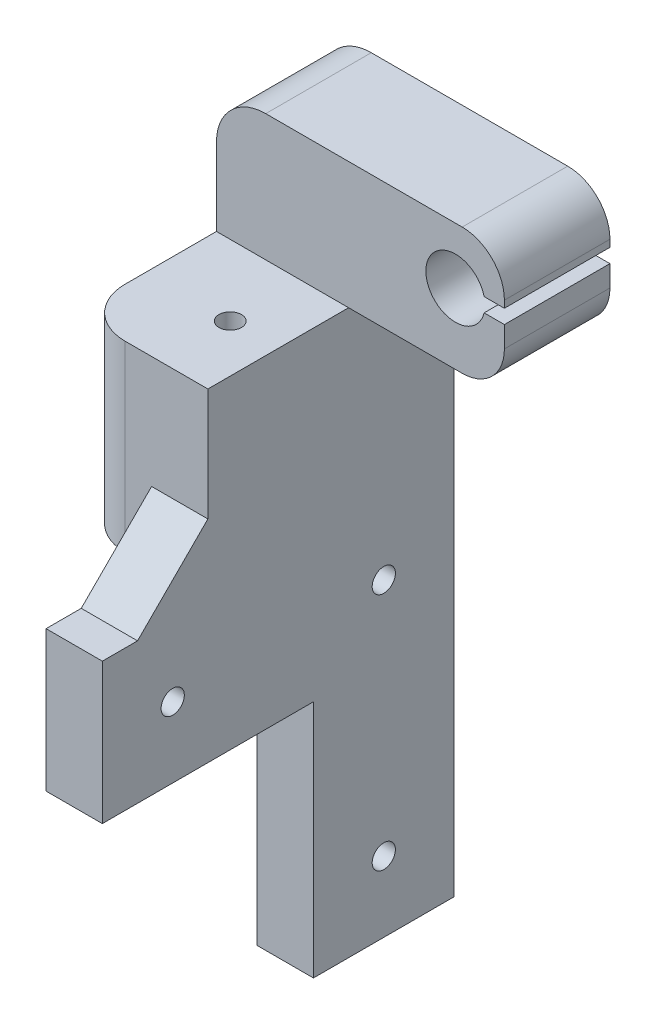
ISO-10303-21;
HEADER;
FILE_DESCRIPTION(('STEP AP214'),'2;1');
FILE_NAME('part.step','',(''),(''),'','','');
FILE_SCHEMA(('AUTOMOTIVE_DESIGN { 1 0 10303 214 1 1 1 1 }'));
ENDSEC;
DATA;
#1=APPLICATION_CONTEXT('core data for automotive mechanical design processes');
#2=APPLICATION_PROTOCOL_DEFINITION('international standard','automotive_design',2000,#1);
#3=PRODUCT_CONTEXT('',#1,'mechanical');
#4=PRODUCT('Part','Part','',(#3));
#5=PRODUCT_RELATED_PRODUCT_CATEGORY('part','',(#4));
#6=PRODUCT_DEFINITION_FORMATION('','',#4);
#7=PRODUCT_DEFINITION_CONTEXT('part definition',#1,'design');
#8=PRODUCT_DEFINITION('design','',#6,#7);
#9=PRODUCT_DEFINITION_SHAPE('','',#8);
#10=(LENGTH_UNIT() NAMED_UNIT(*) SI_UNIT(.MILLI.,.METRE.));
#11=(NAMED_UNIT(*) PLANE_ANGLE_UNIT() SI_UNIT($,.RADIAN.));
#12=(NAMED_UNIT(*) SI_UNIT($,.STERADIAN.) SOLID_ANGLE_UNIT());
#13=UNCERTAINTY_MEASURE_WITH_UNIT(LENGTH_MEASURE(1.E-05),#10,'distance_accuracy_value','');
#14=(GEOMETRIC_REPRESENTATION_CONTEXT(3) GLOBAL_UNCERTAINTY_ASSIGNED_CONTEXT((#13)) GLOBAL_UNIT_ASSIGNED_CONTEXT((#10,
#11,#12)) REPRESENTATION_CONTEXT('',''));
#15=CARTESIAN_POINT('',(0.,0.,0.));
#16=DIRECTION('',(0.,0.,1.));
#17=DIRECTION('',(1.,0.,0.));
#18=AXIS2_PLACEMENT_3D('',#15,#16,#17);
#19=CARTESIAN_POINT('',(0.,0.,35.));
#20=DIRECTION('',(0.,0.,-1.));
#21=DIRECTION('',(-1.,0.,0.));
#22=AXIS2_PLACEMENT_3D('',#19,#20,#21);
#23=PLANE('',#22);
#24=DIRECTION('',(-1.,0.,0.));
#25=VECTOR('',#24,1.);
#26=CARTESIAN_POINT('',(0.,54.,35.));
#27=LINE('',#26,#25);
#28=CARTESIAN_POINT('',(0.,54.,35.));
#29=VERTEX_POINT('',#28);
#30=CARTESIAN_POINT('',(-3.78,54.,35.));
#31=VERTEX_POINT('',#30);
#32=EDGE_CURVE('E227',#29,#31,#27,.T.);
#33=ORIENTED_EDGE('',*,*,#32,.F.);
#34=DIRECTION('',(0.,1.,0.));
#35=VECTOR('',#34,1.);
#36=CARTESIAN_POINT('',(0.,0.,35.));
#37=LINE('',#36,#35);
#38=CARTESIAN_POINT('',(0.,63.9999999999999,35.));
#39=VERTEX_POINT('',#38);
#40=EDGE_CURVE('E337',#29,#39,#37,.T.);
#41=ORIENTED_EDGE('',*,*,#40,.T.);
#42=DIRECTION('',(1.,0.,0.));
#43=VECTOR('',#42,1.);
#44=CARTESIAN_POINT('',(8.,63.9999999999999,35.));
#45=LINE('',#44,#43);
#46=CARTESIAN_POINT('',(8.,63.9999999999999,35.));
#47=VERTEX_POINT('',#46);
#48=EDGE_CURVE('E335',#39,#47,#45,.T.);
#49=ORIENTED_EDGE('',*,*,#48,.T.);
#50=DIRECTION('',(0.,1.,0.));
#51=VECTOR('',#50,1.);
#52=CARTESIAN_POINT('',(8.,80.,35.));
#53=LINE('',#52,#51);
#54=CARTESIAN_POINT('',(8.,80.,35.));
#55=VERTEX_POINT('',#54);
#56=EDGE_CURVE('E303',#47,#55,#53,.T.);
#57=ORIENTED_EDGE('',*,*,#56,.T.);
#58=DIRECTION('',(-1.,0.,0.));
#59=VECTOR('',#58,1.);
#60=CARTESIAN_POINT('',(8.,80.,35.));
#61=LINE('',#60,#59);
#62=CARTESIAN_POINT('',(-3.78,80.,35.));
#63=VERTEX_POINT('',#62);
#64=EDGE_CURVE('E305',#55,#63,#61,.T.);
#65=ORIENTED_EDGE('',*,*,#64,.T.);
#66=DIRECTION('',(0.,-1.,0.));
#67=VECTOR('',#66,1.);
#68=CARTESIAN_POINT('',(-3.78,0.,35.));
#69=LINE('',#68,#67);
#70=EDGE_CURVE('E504',#63,#31,#69,.T.);
#71=ORIENTED_EDGE('',*,*,#70,.T.);
#72=EDGE_LOOP('',(#33,#41,#49,#57,#65,#71));
#73=FACE_BOUND('',#72,.T.);
#74=ADVANCED_FACE('F36',(#73),#23,.F.);
#75=CARTESIAN_POINT('',(-3.78,0.,28.));
#76=DIRECTION('',(0.,-1.,0.));
#77=DIRECTION('',(0.,0.,-1.));
#78=AXIS2_PLACEMENT_3D('',#75,#76,#77);
#79=CYLINDRICAL_SURFACE('',#78,7.);
#80=CARTESIAN_POINT('',(-3.78,54.,28.));
#81=DIRECTION('',(0.,1.,0.));
#82=DIRECTION('',(0.,0.,1.));
#83=AXIS2_PLACEMENT_3D('',#80,#81,#82);
#84=CIRCLE('',#83,7.);
#85=CARTESIAN_POINT('',(-10.78,54.,28.));
#86=VERTEX_POINT('',#85);
#87=EDGE_CURVE('E326',#31,#86,#84,.F.);
#88=ORIENTED_EDGE('',*,*,#87,.F.);
#89=ORIENTED_EDGE('',*,*,#70,.F.);
#90=CARTESIAN_POINT('',(-3.78,80.,28.));
#91=DIRECTION('',(0.,-1.,0.));
#92=DIRECTION('',(0.,0.,-1.));
#93=AXIS2_PLACEMENT_3D('',#90,#91,#92);
#94=CIRCLE('',#93,7.);
#95=CARTESIAN_POINT('',(-10.78,80.,28.));
#96=VERTEX_POINT('',#95);
#97=EDGE_CURVE('E330',#96,#63,#94,.F.);
#98=ORIENTED_EDGE('',*,*,#97,.F.);
#99=DIRECTION('',(0.,-1.,0.));
#100=VECTOR('',#99,1.);
#101=CARTESIAN_POINT('',(-10.78,54.,28.));
#102=LINE('',#101,#100);
#103=EDGE_CURVE('E328',#86,#96,#102,.F.);
#104=ORIENTED_EDGE('',*,*,#103,.F.);
#105=EDGE_LOOP('',(#88,#89,#98,#104));
#106=FACE_BOUND('',#105,.T.);
#107=ADVANCED_FACE('F382',(#106),#79,.T.);
#108=CARTESIAN_POINT('',(0.,50.,15.));
#109=DIRECTION('',(-0.707106781186551,-0.707106781186544,0.));
#110=DIRECTION('',(0.,0.,1.));
#111=AXIS2_PLACEMENT_3D('',#108,#109,#110);
#112=PLANE('',#111);
#113=DIRECTION('',(-0.707106781186544,0.707106781186551,0.));
#114=VECTOR('',#113,1.);
#115=CARTESIAN_POINT('',(0.,50.,20.));
#116=LINE('',#115,#114);
#117=CARTESIAN_POINT('',(-4.00000000000002,54.,20.));
#118=VERTEX_POINT('',#117);
#119=CARTESIAN_POINT('',(0.,50.,20.));
#120=VERTEX_POINT('',#119);
#121=EDGE_CURVE('E11',#118,#120,#116,.F.);
#122=ORIENTED_EDGE('',*,*,#121,.F.);
#123=DIRECTION('',(0.,0.,1.));
#124=VECTOR('',#123,1.);
#125=CARTESIAN_POINT('',(-3.99999999999999,54.,35.));
#126=LINE('',#125,#124);
#127=CARTESIAN_POINT('',(-3.99999999999999,54.,0.));
#128=VERTEX_POINT('',#127);
#129=EDGE_CURVE('E223',#128,#118,#126,.T.);
#130=ORIENTED_EDGE('',*,*,#129,.F.);
#131=DIRECTION('',(0.707106781186544,-0.707106781186551,0.));
#132=VECTOR('',#131,1.);
#133=CARTESIAN_POINT('',(25.,24.9999999999997,0.));
#134=LINE('',#133,#132);
#135=CARTESIAN_POINT('',(0.,50.,0.));
#136=VERTEX_POINT('',#135);
#137=EDGE_CURVE('E61',#136,#128,#134,.F.);
#138=ORIENTED_EDGE('',*,*,#137,.F.);
#139=DIRECTION('',(0.,0.,-1.));
#140=VECTOR('',#139,1.);
#141=CARTESIAN_POINT('',(0.,50.,0.));
#142=LINE('',#141,#140);
#143=EDGE_CURVE('E344',#120,#136,#142,.T.);
#144=ORIENTED_EDGE('',*,*,#143,.F.);
#145=EDGE_LOOP('',(#122,#130,#138,#144));
#146=FACE_BOUND('',#145,.T.);
#147=ADVANCED_FACE('F38',(#146),#112,.T.);
#148=CARTESIAN_POINT('',(0.,0.,15.));
#149=DIRECTION('',(1.,0.,0.));
#150=DIRECTION('',(0.,0.,-1.));
#151=AXIS2_PLACEMENT_3D('',#148,#149,#150);
#152=PLANE('',#151);
#153=CARTESIAN_POINT('',(0.,44.,10.));
#154=DIRECTION('',(-1.,0.,0.));
#155=DIRECTION('',(0.,0.,1.));
#156=AXIS2_PLACEMENT_3D('',#153,#154,#155);
#157=CIRCLE('',#156,1.65);
#158=CARTESIAN_POINT('',(0.,44.,11.65));
#159=VERTEX_POINT('',#158);
#160=EDGE_CURVE('E362',#159,#159,#157,.T.);
#161=ORIENTED_EDGE('',*,*,#160,.F.);
#162=EDGE_LOOP('',(#161));
#163=FACE_BOUND('',#162,.T.);
#164=CARTESIAN_POINT('',(0.,10.,10.));
#165=DIRECTION('',(-1.,0.,0.));
#166=DIRECTION('',(0.,0.,1.));
#167=AXIS2_PLACEMENT_3D('',#164,#165,#166);
#168=CIRCLE('',#167,1.65);
#169=CARTESIAN_POINT('',(0.,10.,11.65));
#170=VERTEX_POINT('',#169);
#171=EDGE_CURVE('E353',#170,#170,#168,.T.);
#172=ORIENTED_EDGE('',*,*,#171,.F.);
#173=EDGE_LOOP('',(#172));
#174=FACE_BOUND('',#173,.T.);
#175=DIRECTION('',(0.,1.,0.));
#176=VECTOR('',#175,1.);
#177=CARTESIAN_POINT('',(0.,-99.,24.0148188564314));
#178=LINE('',#177,#176);
#179=CARTESIAN_POINT('',(0.,33.9999999999999,24.0148188564314));
#180=VERTEX_POINT('',#179);
#181=CARTESIAN_POINT('',(0.,54.,24.0148188564314));
#182=VERTEX_POINT('',#181);
#183=EDGE_CURVE('E235',#180,#182,#178,.T.);
#184=ORIENTED_EDGE('',*,*,#183,.T.);
#185=DIRECTION('',(0.,0.,-1.));
#186=VECTOR('',#185,1.);
#187=CARTESIAN_POINT('',(0.,54.,20.));
#188=LINE('',#187,#186);
#189=CARTESIAN_POINT('',(0.,54.,20.));
#190=VERTEX_POINT('',#189);
#191=EDGE_CURVE('E221',#182,#190,#188,.T.);
#192=ORIENTED_EDGE('',*,*,#191,.T.);
#193=DIRECTION('',(0.,-1.,0.));
#194=VECTOR('',#193,1.);
#195=CARTESIAN_POINT('',(0.,34.,20.));
#196=LINE('',#195,#194);
#197=EDGE_CURVE('E228',#190,#120,#196,.T.);
#198=ORIENTED_EDGE('',*,*,#197,.T.);
#199=ORIENTED_EDGE('',*,*,#143,.T.);
#200=DIRECTION('',(0.,-1.,0.));
#201=VECTOR('',#200,1.);
#202=CARTESIAN_POINT('',(0.,0.,0.));
#203=LINE('',#202,#201);
#204=CARTESIAN_POINT('',(0.,0.,0.));
#205=VERTEX_POINT('',#204);
#206=EDGE_CURVE('E446',#136,#205,#203,.T.);
#207=ORIENTED_EDGE('',*,*,#206,.T.);
#208=DIRECTION('',(0.,0.,-1.));
#209=VECTOR('',#208,1.);
#210=CARTESIAN_POINT('',(0.,0.,15.));
#211=LINE('',#210,#209);
#212=CARTESIAN_POINT('',(0.,0.,20.));
#213=VERTEX_POINT('',#212);
#214=EDGE_CURVE('E317',#213,#205,#211,.T.);
#215=ORIENTED_EDGE('',*,*,#214,.F.);
#216=DIRECTION('',(0.,-1.,0.));
#217=VECTOR('',#216,1.);
#218=CARTESIAN_POINT('',(0.,54.,20.));
#219=LINE('',#218,#217);
#220=CARTESIAN_POINT('',(0.,34.,20.));
#221=VERTEX_POINT('',#220);
#222=EDGE_CURVE('E295',#221,#213,#219,.T.);
#223=ORIENTED_EDGE('',*,*,#222,.F.);
#224=DIRECTION('',(0.,0.,-1.));
#225=VECTOR('',#224,1.);
#226=CARTESIAN_POINT('',(0.,34.,50.));
#227=LINE('',#226,#225);
#228=EDGE_CURVE('E292',#180,#221,#227,.T.);
#229=ORIENTED_EDGE('',*,*,#228,.F.);
#230=EDGE_LOOP('',(#184,#192,#198,#199,#207,#215,#223,#229));
#231=FACE_BOUND('',#230,.T.);
#232=ADVANCED_FACE('F232',(#163,#174,#231),#152,.F.);
#233=CARTESIAN_POINT('',(30.14,80.,15.));
#234=DIRECTION('',(-1.,0.,0.));
#235=DIRECTION('',(0.,0.,1.));
#236=AXIS2_PLACEMENT_3D('',#233,#234,#235);
#237=PLANE('',#236);
#238=DIRECTION('',(0.,1.,0.));
#239=VECTOR('',#238,1.);
#240=CARTESIAN_POINT('',(30.14,80.,0.));
#241=LINE('',#240,#239);
#242=CARTESIAN_POINT('',(30.14,91.,0.));
#243=VERTEX_POINT('',#242);
#244=CARTESIAN_POINT('',(30.14,92.,0.));
#245=VERTEX_POINT('',#244);
#246=EDGE_CURVE('E458',#243,#245,#241,.T.);
#247=ORIENTED_EDGE('',*,*,#246,.T.);
#248=DIRECTION('',(0.,0.,-1.));
#249=VECTOR('',#248,1.);
#250=CARTESIAN_POINT('',(30.14,92.,15.));
#251=LINE('',#250,#249);
#252=CARTESIAN_POINT('',(30.14,92.,15.));
#253=VERTEX_POINT('',#252);
#254=EDGE_CURVE('E544',#245,#253,#251,.F.);
#255=ORIENTED_EDGE('',*,*,#254,.T.);
#256=DIRECTION('',(0.,1.,0.));
#257=VECTOR('',#256,1.);
#258=CARTESIAN_POINT('',(30.14,80.,15.));
#259=LINE('',#258,#257);
#260=CARTESIAN_POINT('',(30.14,91.,15.));
#261=VERTEX_POINT('',#260);
#262=EDGE_CURVE('E561',#261,#253,#259,.T.);
#263=ORIENTED_EDGE('',*,*,#262,.F.);
#264=DIRECTION('',(0.,0.,1.));
#265=VECTOR('',#264,1.);
#266=CARTESIAN_POINT('',(30.14,91.,-15.));
#267=LINE('',#266,#265);
#268=EDGE_CURVE('E266',#243,#261,#267,.T.);
#269=ORIENTED_EDGE('',*,*,#268,.F.);
#270=EDGE_LOOP('',(#247,#255,#263,#269));
#271=FACE_BOUND('',#270,.T.);
#272=ADVANCED_FACE('F372',(#271),#237,.F.);
#273=CARTESIAN_POINT('',(0.,54.,15.));
#274=DIRECTION('',(0.,1.,0.));
#275=DIRECTION('',(0.,0.,1.));
#276=AXIS2_PLACEMENT_3D('',#273,#274,#275);
#277=PLANE('',#276);
#278=DIRECTION('',(0.,0.,-1.));
#279=VECTOR('',#278,1.);
#280=CARTESIAN_POINT('',(-10.78,54.,15.));
#281=LINE('',#280,#279);
#282=CARTESIAN_POINT('',(-10.78,54.,0.));
#283=VERTEX_POINT('',#282);
#284=EDGE_CURVE('E473',#86,#283,#281,.T.);
#285=ORIENTED_EDGE('',*,*,#284,.T.);
#286=DIRECTION('',(1.,0.,0.));
#287=VECTOR('',#286,1.);
#288=CARTESIAN_POINT('',(0.,54.,0.));
#289=LINE('',#288,#287);
#290=EDGE_CURVE('E470',#283,#128,#289,.T.);
#291=ORIENTED_EDGE('',*,*,#290,.T.);
#292=ORIENTED_EDGE('',*,*,#129,.T.);
#293=DIRECTION('',(1.,0.,0.));
#294=VECTOR('',#293,1.);
#295=CARTESIAN_POINT('',(-179.,54.,20.));
#296=LINE('',#295,#294);
#297=EDGE_CURVE('E217',#118,#190,#296,.T.);
#298=ORIENTED_EDGE('',*,*,#297,.T.);
#299=ORIENTED_EDGE('',*,*,#191,.F.);
#300=CARTESIAN_POINT('',(1.22,54.,25.05));
#301=DIRECTION('',(0.,-1.,0.));
#302=DIRECTION('',(0.,0.,-1.));
#303=AXIS2_PLACEMENT_3D('',#300,#301,#302);
#304=CIRCLE('',#303,1.6);
#305=CARTESIAN_POINT('',(0.,54.,26.0851811435686));
#306=VERTEX_POINT('',#305);
#307=EDGE_CURVE('E45',#182,#306,#304,.F.);
#308=ORIENTED_EDGE('',*,*,#307,.T.);
#309=EDGE_CURVE('E236',#29,#306,#188,.T.);
#310=ORIENTED_EDGE('',*,*,#309,.F.);
#311=ORIENTED_EDGE('',*,*,#32,.T.);
#312=ORIENTED_EDGE('',*,*,#87,.T.);
#313=EDGE_LOOP('',(#285,#291,#292,#298,#299,#308,#310,#311,#312));
#314=FACE_BOUND('',#313,.T.);
#315=ADVANCED_FACE('F219',(#314),#277,.F.);
#316=CARTESIAN_POINT('',(0.,0.,20.));
#317=DIRECTION('',(0.,0.,1.));
#318=DIRECTION('',(1.,0.,0.));
#319=AXIS2_PLACEMENT_3D('',#316,#317,#318);
#320=PLANE('',#319);
#321=DIRECTION('',(0.,1.,0.));
#322=VECTOR('',#321,1.);
#323=CARTESIAN_POINT('',(8.,54.,20.));
#324=LINE('',#323,#322);
#325=CARTESIAN_POINT('',(8.,0.,20.));
#326=VERTEX_POINT('',#325);
#327=CARTESIAN_POINT('',(8.,34.,20.));
#328=VERTEX_POINT('',#327);
#329=EDGE_CURVE('E300',#326,#328,#324,.T.);
#330=ORIENTED_EDGE('',*,*,#329,.T.);
#331=DIRECTION('',(1.,0.,0.));
#332=VECTOR('',#331,1.);
#333=CARTESIAN_POINT('',(0.,34.,20.));
#334=LINE('',#333,#332);
#335=EDGE_CURVE('E265',#221,#328,#334,.T.);
#336=ORIENTED_EDGE('',*,*,#335,.F.);
#337=ORIENTED_EDGE('',*,*,#222,.T.);
#338=DIRECTION('',(1.,0.,0.));
#339=VECTOR('',#338,1.);
#340=CARTESIAN_POINT('',(0.,0.,20.));
#341=LINE('',#340,#339);
#342=EDGE_CURVE('E297',#213,#326,#341,.T.);
#343=ORIENTED_EDGE('',*,*,#342,.T.);
#344=EDGE_LOOP('',(#330,#336,#337,#343));
#345=FACE_BOUND('',#344,.T.);
#346=ADVANCED_FACE('F388',(#345),#320,.T.);
#347=CARTESIAN_POINT('',(0.,44.,40.));
#348=DIRECTION('',(-1.,0.,0.));
#349=DIRECTION('',(0.,0.,1.));
#350=AXIS2_PLACEMENT_3D('',#347,#348,#349);
#351=CIRCLE('',#350,1.65);
#352=CARTESIAN_POINT('',(0.,44.,41.65));
#353=VERTEX_POINT('',#352);
#354=EDGE_CURVE('E350',#353,#353,#351,.T.);
#355=ORIENTED_EDGE('',*,*,#354,.F.);
#356=EDGE_LOOP('',(#355));
#357=FACE_BOUND('',#356,.T.);
#358=DIRECTION('',(0.,1.,0.));
#359=VECTOR('',#358,1.);
#360=CARTESIAN_POINT('',(0.,-99.,26.0851811435686));
#361=LINE('',#360,#359);
#362=CARTESIAN_POINT('',(0.,33.9999999999999,26.0851811435686));
#363=VERTEX_POINT('',#362);
#364=EDGE_CURVE('E53',#306,#363,#361,.F.);
#365=ORIENTED_EDGE('',*,*,#364,.T.);
#366=CARTESIAN_POINT('',(0.,34.,50.));
#367=VERTEX_POINT('',#366);
#368=EDGE_CURVE('E293',#367,#363,#227,.T.);
#369=ORIENTED_EDGE('',*,*,#368,.F.);
#370=DIRECTION('',(0.,-1.,0.));
#371=VECTOR('',#370,1.);
#372=CARTESIAN_POINT('',(0.,54.,50.));
#373=LINE('',#372,#371);
#374=CARTESIAN_POINT('',(0.,54.,50.));
#375=VERTEX_POINT('',#374);
#376=EDGE_CURVE('E272',#375,#367,#373,.T.);
#377=ORIENTED_EDGE('',*,*,#376,.F.);
#378=DIRECTION('',(0.,0.,-1.));
#379=VECTOR('',#378,1.);
#380=CARTESIAN_POINT('',(0.,54.,50.));
#381=LINE('',#380,#379);
#382=CARTESIAN_POINT('',(0.,54.,45.0000000000001));
#383=VERTEX_POINT('',#382);
#384=EDGE_CURVE('E281',#375,#383,#381,.T.);
#385=ORIENTED_EDGE('',*,*,#384,.T.);
#386=DIRECTION('',(0.,-0.707106781186543,0.707106781186552));
#387=VECTOR('',#386,1.);
#388=CARTESIAN_POINT('',(0.,42.0000000000004,56.9999999999999));
#389=LINE('',#388,#387);
#390=EDGE_CURVE('E339',#383,#39,#389,.F.);
#391=ORIENTED_EDGE('',*,*,#390,.T.);
#392=ORIENTED_EDGE('',*,*,#40,.F.);
#393=ORIENTED_EDGE('',*,*,#309,.T.);
#394=EDGE_LOOP('',(#365,#369,#377,#385,#391,#392,#393));
#395=FACE_BOUND('',#394,.T.);
#396=ADVANCED_FACE('F374',(#357,#395),#152,.F.);
#397=CARTESIAN_POINT('',(0.,0.,15.));
#398=DIRECTION('',(0.,1.,0.));
#399=DIRECTION('',(0.,0.,1.));
#400=AXIS2_PLACEMENT_3D('',#397,#398,#399);
#401=PLANE('',#400);
#402=DIRECTION('',(1.,0.,0.));
#403=VECTOR('',#402,1.);
#404=CARTESIAN_POINT('',(0.,0.,0.));
#405=LINE('',#404,#403);
#406=CARTESIAN_POINT('',(8.,0.,0.));
#407=VERTEX_POINT('',#406);
#408=EDGE_CURVE('E439',#205,#407,#405,.T.);
#409=ORIENTED_EDGE('',*,*,#408,.T.);
#410=DIRECTION('',(0.,0.,-1.));
#411=VECTOR('',#410,1.);
#412=CARTESIAN_POINT('',(8.,0.,15.));
#413=LINE('',#412,#411);
#414=EDGE_CURVE('E442',#326,#407,#413,.T.);
#415=ORIENTED_EDGE('',*,*,#414,.F.);
#416=ORIENTED_EDGE('',*,*,#342,.F.);
#417=ORIENTED_EDGE('',*,*,#214,.T.);
#418=EDGE_LOOP('',(#409,#415,#416,#417));
#419=FACE_BOUND('',#418,.T.);
#420=ADVANCED_FACE('F387',(#419),#401,.F.);
#421=CARTESIAN_POINT('',(8.,0.,15.));
#422=DIRECTION('',(-1.,0.,0.));
#423=DIRECTION('',(0.,0.,1.));
#424=AXIS2_PLACEMENT_3D('',#421,#422,#423);
#425=PLANE('',#424);
#426=CARTESIAN_POINT('',(8.00000000000001,44.,10.));
#427=DIRECTION('',(-1.,0.,0.));
#428=DIRECTION('',(0.,0.,1.));
#429=AXIS2_PLACEMENT_3D('',#426,#427,#428);
#430=CIRCLE('',#429,1.65);
#431=CARTESIAN_POINT('',(8.00000000000001,44.,11.65));
#432=VERTEX_POINT('',#431);
#433=EDGE_CURVE('E40',#432,#432,#430,.T.);
#434=ORIENTED_EDGE('',*,*,#433,.T.);
#435=EDGE_LOOP('',(#434));
#436=FACE_BOUND('',#435,.T.);
#437=CARTESIAN_POINT('',(8.00000000000001,10.,10.));
#438=DIRECTION('',(-1.,0.,0.));
#439=DIRECTION('',(0.,0.,1.));
#440=AXIS2_PLACEMENT_3D('',#437,#438,#439);
#441=CIRCLE('',#440,1.65);
#442=CARTESIAN_POINT('',(8.00000000000001,10.,11.65));
#443=VERTEX_POINT('',#442);
#444=EDGE_CURVE('E351',#443,#443,#441,.T.);
#445=ORIENTED_EDGE('',*,*,#444,.T.);
#446=EDGE_LOOP('',(#445));
#447=FACE_BOUND('',#446,.T.);
#448=CARTESIAN_POINT('',(8.00000000000001,44.,40.));
#449=DIRECTION('',(-1.,0.,0.));
#450=DIRECTION('',(0.,0.,1.));
#451=AXIS2_PLACEMENT_3D('',#448,#449,#450);
#452=CIRCLE('',#451,1.65);
#453=CARTESIAN_POINT('',(8.00000000000001,44.,41.65));
#454=VERTEX_POINT('',#453);
#455=EDGE_CURVE('E237',#454,#454,#452,.T.);
#456=ORIENTED_EDGE('',*,*,#455,.T.);
#457=EDGE_LOOP('',(#456));
#458=FACE_BOUND('',#457,.T.);
#459=DIRECTION('',(0.,1.,0.));
#460=VECTOR('',#459,1.);
#461=CARTESIAN_POINT('',(8.,0.,0.));
#462=LINE('',#461,#460);
#463=CARTESIAN_POINT('',(8.,80.,0.));
#464=VERTEX_POINT('',#463);
#465=EDGE_CURVE('E445',#407,#464,#462,.T.);
#466=ORIENTED_EDGE('',*,*,#465,.T.);
#467=DIRECTION('',(0.,0.,-1.));
#468=VECTOR('',#467,1.);
#469=CARTESIAN_POINT('',(8.,80.,15.));
#470=LINE('',#469,#468);
#471=CARTESIAN_POINT('',(8.,80.,15.));
#472=VERTEX_POINT('',#471);
#473=EDGE_CURVE('E452',#472,#464,#470,.T.);
#474=ORIENTED_EDGE('',*,*,#473,.F.);
#475=DIRECTION('',(0.,0.,-1.));
#476=VECTOR('',#475,1.);
#477=CARTESIAN_POINT('',(8.,80.,35.));
#478=LINE('',#477,#476);
#479=EDGE_CURVE('E311',#55,#472,#478,.T.);
#480=ORIENTED_EDGE('',*,*,#479,.F.);
#481=ORIENTED_EDGE('',*,*,#56,.F.);
#482=DIRECTION('',(0.,0.707106781186543,-0.707106781186552));
#483=VECTOR('',#482,1.);
#484=CARTESIAN_POINT('',(8.,42.0000000000004,56.9999999999999));
#485=LINE('',#484,#483);
#486=CARTESIAN_POINT('',(8.,54.,45.0000000000001));
#487=VERTEX_POINT('',#486);
#488=EDGE_CURVE('E342',#47,#487,#485,.F.);
#489=ORIENTED_EDGE('',*,*,#488,.T.);
#490=DIRECTION('',(0.,0.,-1.));
#491=VECTOR('',#490,1.);
#492=CARTESIAN_POINT('',(8.,54.,50.));
#493=LINE('',#492,#491);
#494=CARTESIAN_POINT('',(8.,54.,50.));
#495=VERTEX_POINT('',#494);
#496=EDGE_CURVE('E286',#495,#487,#493,.T.);
#497=ORIENTED_EDGE('',*,*,#496,.F.);
#498=DIRECTION('',(0.,1.,0.));
#499=VECTOR('',#498,1.);
#500=CARTESIAN_POINT('',(8.,54.,50.));
#501=LINE('',#500,#499);
#502=CARTESIAN_POINT('',(8.,34.,50.));
#503=VERTEX_POINT('',#502);
#504=EDGE_CURVE('E277',#503,#495,#501,.T.);
#505=ORIENTED_EDGE('',*,*,#504,.F.);
#506=DIRECTION('',(0.,0.,-1.));
#507=VECTOR('',#506,1.);
#508=CARTESIAN_POINT('',(8.,34.,50.));
#509=LINE('',#508,#507);
#510=EDGE_CURVE('E289',#503,#328,#509,.T.);
#511=ORIENTED_EDGE('',*,*,#510,.T.);
#512=ORIENTED_EDGE('',*,*,#329,.F.);
#513=ORIENTED_EDGE('',*,*,#414,.T.);
#514=EDGE_LOOP('',(#466,#474,#480,#481,#489,#497,#505,#511,#512,#513));
#515=FACE_BOUND('',#514,.T.);
#516=ADVANCED_FACE('F429',(#436,#447,#458,#515),#425,.F.);
#517=CARTESIAN_POINT('',(8.,80.,15.));
#518=DIRECTION('',(0.,1.,0.));
#519=DIRECTION('',(0.,0.,1.));
#520=AXIS2_PLACEMENT_3D('',#517,#518,#519);
#521=PLANE('',#520);
#522=DIRECTION('',(1.,0.,0.));
#523=VECTOR('',#522,1.);
#524=CARTESIAN_POINT('',(8.,80.,0.));
#525=LINE('',#524,#523);
#526=CARTESIAN_POINT('',(24.14,80.,0.));
#527=VERTEX_POINT('',#526);
#528=EDGE_CURVE('E456',#464,#527,#525,.T.);
#529=ORIENTED_EDGE('',*,*,#528,.T.);
#530=DIRECTION('',(0.,0.,-1.));
#531=VECTOR('',#530,1.);
#532=CARTESIAN_POINT('',(24.14,80.,15.));
#533=LINE('',#532,#531);
#534=CARTESIAN_POINT('',(24.14,80.,15.));
#535=VERTEX_POINT('',#534);
#536=EDGE_CURVE('E552',#527,#535,#533,.F.);
#537=ORIENTED_EDGE('',*,*,#536,.T.);
#538=DIRECTION('',(1.,0.,0.));
#539=VECTOR('',#538,1.);
#540=CARTESIAN_POINT('',(8.,80.,15.));
#541=LINE('',#540,#539);
#542=EDGE_CURVE('E472',#472,#535,#541,.T.);
#543=ORIENTED_EDGE('',*,*,#542,.F.);
#544=ORIENTED_EDGE('',*,*,#473,.T.);
#545=EDGE_LOOP('',(#529,#537,#543,#544));
#546=FACE_BOUND('',#545,.T.);
#547=ADVANCED_FACE('F425',(#546),#521,.F.);
#548=CARTESIAN_POINT('',(30.14,86.,15.));
#549=VERTEX_POINT('',#548);
#550=CARTESIAN_POINT('',(30.14,89.,15.));
#551=VERTEX_POINT('',#550);
#552=EDGE_CURVE('E557',#549,#551,#259,.T.);
#553=ORIENTED_EDGE('',*,*,#552,.F.);
#554=DIRECTION('',(0.,0.,-1.));
#555=VECTOR('',#554,1.);
#556=CARTESIAN_POINT('',(30.14,86.,15.));
#557=LINE('',#556,#555);
#558=CARTESIAN_POINT('',(30.14,86.,0.));
#559=VERTEX_POINT('',#558);
#560=EDGE_CURVE('E548',#549,#559,#557,.T.);
#561=ORIENTED_EDGE('',*,*,#560,.T.);
#562=CARTESIAN_POINT('',(30.14,89.,0.));
#563=VERTEX_POINT('',#562);
#564=EDGE_CURVE('E462',#559,#563,#241,.T.);
#565=ORIENTED_EDGE('',*,*,#564,.T.);
#566=DIRECTION('',(0.,0.,1.));
#567=VECTOR('',#566,1.);
#568=CARTESIAN_POINT('',(30.14,89.,-15.));
#569=LINE('',#568,#567);
#570=EDGE_CURVE('E268',#563,#551,#569,.T.);
#571=ORIENTED_EDGE('',*,*,#570,.T.);
#572=EDGE_LOOP('',(#553,#561,#565,#571));
#573=FACE_BOUND('',#572,.T.);
#574=ADVANCED_FACE('F381',(#573),#237,.F.);
#575=CARTESIAN_POINT('',(-10.78,98.,15.));
#576=DIRECTION('',(0.,-1.,0.));
#577=DIRECTION('',(0.,0.,-1.));
#578=AXIS2_PLACEMENT_3D('',#575,#576,#577);
#579=PLANE('',#578);
#580=DIRECTION('',(-1.,0.,0.));
#581=VECTOR('',#580,1.);
#582=CARTESIAN_POINT('',(-10.78,98.,0.));
#583=LINE('',#582,#581);
#584=CARTESIAN_POINT('',(24.14,98.,0.));
#585=VERTEX_POINT('',#584);
#586=CARTESIAN_POINT('',(-3.78,98.,0.));
#587=VERTEX_POINT('',#586);
#588=EDGE_CURVE('E464',#585,#587,#583,.T.);
#589=ORIENTED_EDGE('',*,*,#588,.T.);
#590=DIRECTION('',(0.,0.,-1.));
#591=VECTOR('',#590,1.);
#592=CARTESIAN_POINT('',(-3.78,98.,15.));
#593=LINE('',#592,#591);
#594=CARTESIAN_POINT('',(-3.78,98.,15.));
#595=VERTEX_POINT('',#594);
#596=EDGE_CURVE('E501',#587,#595,#593,.F.);
#597=ORIENTED_EDGE('',*,*,#596,.T.);
#598=DIRECTION('',(-1.,0.,0.));
#599=VECTOR('',#598,1.);
#600=CARTESIAN_POINT('',(-10.78,98.,15.));
#601=LINE('',#600,#599);
#602=CARTESIAN_POINT('',(24.14,98.,15.));
#603=VERTEX_POINT('',#602);
#604=EDGE_CURVE('E488',#603,#595,#601,.T.);
#605=ORIENTED_EDGE('',*,*,#604,.F.);
#606=DIRECTION('',(0.,0.,-1.));
#607=VECTOR('',#606,1.);
#608=CARTESIAN_POINT('',(24.14,98.,15.));
#609=LINE('',#608,#607);
#610=EDGE_CURVE('E537',#603,#585,#609,.T.);
#611=ORIENTED_EDGE('',*,*,#610,.T.);
#612=EDGE_LOOP('',(#589,#597,#605,#611));
#613=FACE_BOUND('',#612,.T.);
#614=ADVANCED_FACE('F419',(#613),#579,.F.);
#615=CARTESIAN_POINT('',(-10.78,54.,15.));
#616=DIRECTION('',(1.,0.,0.));
#617=DIRECTION('',(0.,0.,-1.));
#618=AXIS2_PLACEMENT_3D('',#615,#616,#617);
#619=PLANE('',#618);
#620=ORIENTED_EDGE('',*,*,#284,.F.);
#621=ORIENTED_EDGE('',*,*,#103,.T.);
#622=DIRECTION('',(0.,0.,-1.));
#623=VECTOR('',#622,1.);
#624=CARTESIAN_POINT('',(-10.78,80.,35.));
#625=LINE('',#624,#623);
#626=CARTESIAN_POINT('',(-10.78,80.,15.));
#627=VERTEX_POINT('',#626);
#628=EDGE_CURVE('E308',#96,#627,#625,.T.);
#629=ORIENTED_EDGE('',*,*,#628,.T.);
#630=DIRECTION('',(0.,-1.,0.));
#631=VECTOR('',#630,1.);
#632=CARTESIAN_POINT('',(-10.78,54.,15.));
#633=LINE('',#632,#631);
#634=CARTESIAN_POINT('',(-10.78,91.,15.));
#635=VERTEX_POINT('',#634);
#636=EDGE_CURVE('E475',#635,#627,#633,.T.);
#637=ORIENTED_EDGE('',*,*,#636,.F.);
#638=DIRECTION('',(0.,0.,-1.));
#639=VECTOR('',#638,1.);
#640=CARTESIAN_POINT('',(-10.78,91.,15.));
#641=LINE('',#640,#639);
#642=CARTESIAN_POINT('',(-10.78,91.,0.));
#643=VERTEX_POINT('',#642);
#644=EDGE_CURVE('E496',#635,#643,#641,.T.);
#645=ORIENTED_EDGE('',*,*,#644,.T.);
#646=DIRECTION('',(0.,-1.,0.));
#647=VECTOR('',#646,1.);
#648=CARTESIAN_POINT('',(-10.78,54.,0.));
#649=LINE('',#648,#647);
#650=EDGE_CURVE('E467',#643,#283,#649,.T.);
#651=ORIENTED_EDGE('',*,*,#650,.T.);
#652=EDGE_LOOP('',(#620,#621,#629,#637,#645,#651));
#653=FACE_BOUND('',#652,.T.);
#654=ADVANCED_FACE('F411',(#653),#619,.F.);
#655=CARTESIAN_POINT('',(0.,0.,15.));
#656=DIRECTION('',(0.,0.,1.));
#657=DIRECTION('',(1.,0.,0.));
#658=AXIS2_PLACEMENT_3D('',#655,#656,#657);
#659=PLANE('',#658);
#660=ORIENTED_EDGE('',*,*,#604,.T.);
#661=CARTESIAN_POINT('',(-3.78,91.,15.));
#662=DIRECTION('',(0.,0.,1.));
#663=DIRECTION('',(1.,0.,0.));
#664=AXIS2_PLACEMENT_3D('',#661,#662,#663);
#665=CIRCLE('',#664,7.);
#666=EDGE_CURVE('E503',#595,#635,#665,.T.);
#667=ORIENTED_EDGE('',*,*,#666,.T.);
#668=ORIENTED_EDGE('',*,*,#636,.T.);
#669=DIRECTION('',(-1.,0.,0.));
#670=VECTOR('',#669,1.);
#671=CARTESIAN_POINT('',(8.,80.,15.));
#672=LINE('',#671,#670);
#673=EDGE_CURVE('E302',#472,#627,#672,.T.);
#674=ORIENTED_EDGE('',*,*,#673,.F.);
#675=ORIENTED_EDGE('',*,*,#542,.T.);
#676=CARTESIAN_POINT('',(24.14,86.,15.));
#677=DIRECTION('',(0.,0.,1.));
#678=DIRECTION('',(1.,0.,0.));
#679=AXIS2_PLACEMENT_3D('',#676,#677,#678);
#680=CIRCLE('',#679,6.);
#681=EDGE_CURVE('E494',#535,#549,#680,.T.);
#682=ORIENTED_EDGE('',*,*,#681,.T.);
#683=ORIENTED_EDGE('',*,*,#552,.T.);
#684=DIRECTION('',(1.,0.,0.));
#685=VECTOR('',#684,1.);
#686=CARTESIAN_POINT('',(27.2592156108742,89.,15.));
#687=LINE('',#686,#685);
#688=CARTESIAN_POINT('',(27.2592156108742,89.,15.));
#689=VERTEX_POINT('',#688);
#690=EDGE_CURVE('E256',#689,#551,#687,.T.);
#691=ORIENTED_EDGE('',*,*,#690,.F.);
#692=CARTESIAN_POINT('',(23.18,90.,15.));
#693=DIRECTION('',(0.,0.,1.));
#694=DIRECTION('',(1.,0.,0.));
#695=AXIS2_PLACEMENT_3D('',#692,#693,#694);
#696=CIRCLE('',#695,4.2);
#697=CARTESIAN_POINT('',(27.2592156108742,91.,15.));
#698=VERTEX_POINT('',#697);
#699=EDGE_CURVE('E253',#698,#689,#696,.T.);
#700=ORIENTED_EDGE('',*,*,#699,.F.);
#701=DIRECTION('',(-1.,0.,0.));
#702=VECTOR('',#701,1.);
#703=CARTESIAN_POINT('',(30.14,91.,15.));
#704=LINE('',#703,#702);
#705=EDGE_CURVE('E259',#261,#698,#704,.T.);
#706=ORIENTED_EDGE('',*,*,#705,.F.);
#707=ORIENTED_EDGE('',*,*,#262,.T.);
#708=CARTESIAN_POINT('',(24.14,92.,15.));
#709=DIRECTION('',(0.,0.,1.));
#710=DIRECTION('',(1.,0.,0.));
#711=AXIS2_PLACEMENT_3D('',#708,#709,#710);
#712=CIRCLE('',#711,6.);
#713=EDGE_CURVE('E546',#253,#603,#712,.T.);
#714=ORIENTED_EDGE('',*,*,#713,.T.);
#715=EDGE_LOOP('',(#660,#667,#668,#674,#675,#682,#683,#691,#700,#706,#707,#714));
#716=FACE_BOUND('',#715,.T.);
#717=ADVANCED_FACE('F408',(#716),#659,.T.);
#718=CARTESIAN_POINT('',(0.,0.,0.));
#719=DIRECTION('',(0.,0.,1.));
#720=DIRECTION('',(1.,0.,0.));
#721=AXIS2_PLACEMENT_3D('',#718,#719,#720);
#722=PLANE('',#721);
#723=ORIENTED_EDGE('',*,*,#650,.F.);
#724=CARTESIAN_POINT('',(-3.78,91.,0.));
#725=DIRECTION('',(0.,0.,1.));
#726=DIRECTION('',(1.,0.,0.));
#727=AXIS2_PLACEMENT_3D('',#724,#725,#726);
#728=CIRCLE('',#727,7.);
#729=EDGE_CURVE('E499',#643,#587,#728,.F.);
#730=ORIENTED_EDGE('',*,*,#729,.T.);
#731=ORIENTED_EDGE('',*,*,#588,.F.);
#732=CARTESIAN_POINT('',(24.14,92.,0.));
#733=DIRECTION('',(0.,0.,1.));
#734=DIRECTION('',(1.,0.,0.));
#735=AXIS2_PLACEMENT_3D('',#732,#733,#734);
#736=CIRCLE('',#735,6.);
#737=EDGE_CURVE('E542',#585,#245,#736,.F.);
#738=ORIENTED_EDGE('',*,*,#737,.T.);
#739=ORIENTED_EDGE('',*,*,#246,.F.);
#740=DIRECTION('',(-1.,0.,0.));
#741=VECTOR('',#740,1.);
#742=CARTESIAN_POINT('',(0.,91.,0.));
#743=LINE('',#742,#741);
#744=CARTESIAN_POINT('',(27.2592156108742,91.,0.));
#745=VERTEX_POINT('',#744);
#746=EDGE_CURVE('E535',#243,#745,#743,.T.);
#747=ORIENTED_EDGE('',*,*,#746,.T.);
#748=CARTESIAN_POINT('',(23.18,90.,0.));
#749=DIRECTION('',(0.,0.,1.));
#750=DIRECTION('',(1.,0.,0.));
#751=AXIS2_PLACEMENT_3D('',#748,#749,#750);
#752=CIRCLE('',#751,4.2);
#753=CARTESIAN_POINT('',(27.2592156108742,89.,0.));
#754=VERTEX_POINT('',#753);
#755=EDGE_CURVE('E532',#745,#754,#752,.T.);
#756=ORIENTED_EDGE('',*,*,#755,.T.);
#757=DIRECTION('',(1.,0.,0.));
#758=VECTOR('',#757,1.);
#759=CARTESIAN_POINT('',(0.,89.,0.));
#760=LINE('',#759,#758);
#761=EDGE_CURVE('E321',#754,#563,#760,.T.);
#762=ORIENTED_EDGE('',*,*,#761,.T.);
#763=ORIENTED_EDGE('',*,*,#564,.F.);
#764=CARTESIAN_POINT('',(24.14,86.,0.));
#765=DIRECTION('',(0.,0.,1.));
#766=DIRECTION('',(1.,0.,0.));
#767=AXIS2_PLACEMENT_3D('',#764,#765,#766);
#768=CIRCLE('',#767,6.);
#769=EDGE_CURVE('E551',#559,#527,#768,.F.);
#770=ORIENTED_EDGE('',*,*,#769,.T.);
#771=ORIENTED_EDGE('',*,*,#528,.F.);
#772=ORIENTED_EDGE('',*,*,#465,.F.);
#773=ORIENTED_EDGE('',*,*,#408,.F.);
#774=ORIENTED_EDGE('',*,*,#206,.F.);
#775=ORIENTED_EDGE('',*,*,#137,.T.);
#776=ORIENTED_EDGE('',*,*,#290,.F.);
#777=EDGE_LOOP('',(#723,#730,#731,#738,#739,#747,#756,#762,#763,#770,#771,#772,#773,#774,#775,#776));
#778=FACE_BOUND('',#777,.T.);
#779=ADVANCED_FACE('F406',(#778),#722,.F.);
#780=CARTESIAN_POINT('',(8.,80.,35.));
#781=DIRECTION('',(0.,-1.,0.));
#782=DIRECTION('',(0.,0.,-1.));
#783=AXIS2_PLACEMENT_3D('',#780,#781,#782);
#784=PLANE('',#783);
#785=CARTESIAN_POINT('',(1.22,80.,25.05));
#786=DIRECTION('',(0.,1.,0.));
#787=DIRECTION('',(0.,0.,1.));
#788=AXIS2_PLACEMENT_3D('',#785,#786,#787);
#789=CIRCLE('',#788,1.6);
#790=CARTESIAN_POINT('',(1.22,80.,26.65));
#791=VERTEX_POINT('',#790);
#792=EDGE_CURVE('E245',#791,#791,#789,.T.);
#793=ORIENTED_EDGE('',*,*,#792,.F.);
#794=EDGE_LOOP('',(#793));
#795=FACE_BOUND('',#794,.T.);
#796=ORIENTED_EDGE('',*,*,#628,.F.);
#797=ORIENTED_EDGE('',*,*,#97,.T.);
#798=ORIENTED_EDGE('',*,*,#64,.F.);
#799=ORIENTED_EDGE('',*,*,#479,.T.);
#800=ORIENTED_EDGE('',*,*,#673,.T.);
#801=EDGE_LOOP('',(#796,#797,#798,#799,#800));
#802=FACE_BOUND('',#801,.T.);
#803=ADVANCED_FACE('F402',(#795,#802),#784,.F.);
#804=CARTESIAN_POINT('',(0.,54.,50.));
#805=DIRECTION('',(0.,-1.,0.));
#806=DIRECTION('',(0.,0.,-1.));
#807=AXIS2_PLACEMENT_3D('',#804,#805,#806);
#808=PLANE('',#807);
#809=ORIENTED_EDGE('',*,*,#496,.T.);
#810=DIRECTION('',(-1.,0.,0.));
#811=VECTOR('',#810,1.);
#812=CARTESIAN_POINT('',(0.,54.,45.0000000000001));
#813=LINE('',#812,#811);
#814=EDGE_CURVE('E332',#487,#383,#813,.T.);
#815=ORIENTED_EDGE('',*,*,#814,.T.);
#816=ORIENTED_EDGE('',*,*,#384,.F.);
#817=DIRECTION('',(-1.,0.,0.));
#818=VECTOR('',#817,1.);
#819=CARTESIAN_POINT('',(0.,54.,50.));
#820=LINE('',#819,#818);
#821=EDGE_CURVE('E279',#495,#375,#820,.T.);
#822=ORIENTED_EDGE('',*,*,#821,.F.);
#823=EDGE_LOOP('',(#809,#815,#816,#822));
#824=FACE_BOUND('',#823,.T.);
#825=ADVANCED_FACE('F405',(#824),#808,.F.);
#826=CARTESIAN_POINT('',(0.,34.,50.));
#827=DIRECTION('',(0.,1.,0.));
#828=DIRECTION('',(0.,0.,1.));
#829=AXIS2_PLACEMENT_3D('',#826,#827,#828);
#830=PLANE('',#829);
#831=ORIENTED_EDGE('',*,*,#368,.T.);
#832=CARTESIAN_POINT('',(1.22,34.,25.05));
#833=DIRECTION('',(0.,1.,0.));
#834=DIRECTION('',(0.,0.,1.));
#835=AXIS2_PLACEMENT_3D('',#832,#833,#834);
#836=CIRCLE('',#835,1.6);
#837=EDGE_CURVE('E250',#363,#180,#836,.T.);
#838=ORIENTED_EDGE('',*,*,#837,.T.);
#839=ORIENTED_EDGE('',*,*,#228,.T.);
#840=ORIENTED_EDGE('',*,*,#335,.T.);
#841=ORIENTED_EDGE('',*,*,#510,.F.);
#842=DIRECTION('',(1.,0.,0.));
#843=VECTOR('',#842,1.);
#844=CARTESIAN_POINT('',(0.,34.,50.));
#845=LINE('',#844,#843);
#846=EDGE_CURVE('E275',#367,#503,#845,.T.);
#847=ORIENTED_EDGE('',*,*,#846,.F.);
#848=EDGE_LOOP('',(#831,#838,#839,#840,#841,#847));
#849=FACE_BOUND('',#848,.T.);
#850=ADVANCED_FACE('F527',(#849),#830,.F.);
#851=CARTESIAN_POINT('',(0.,0.,50.));
#852=DIRECTION('',(0.,0.,1.));
#853=DIRECTION('',(1.,0.,0.));
#854=AXIS2_PLACEMENT_3D('',#851,#852,#853);
#855=PLANE('',#854);
#856=ORIENTED_EDGE('',*,*,#376,.T.);
#857=ORIENTED_EDGE('',*,*,#846,.T.);
#858=ORIENTED_EDGE('',*,*,#504,.T.);
#859=ORIENTED_EDGE('',*,*,#821,.T.);
#860=EDGE_LOOP('',(#856,#857,#858,#859));
#861=FACE_BOUND('',#860,.T.);
#862=ADVANCED_FACE('F523',(#861),#855,.T.);
#863=CARTESIAN_POINT('',(23.18,90.,-15.));
#864=DIRECTION('',(0.,0.,1.));
#865=DIRECTION('',(1.,0.,0.));
#866=AXIS2_PLACEMENT_3D('',#863,#864,#865);
#867=CYLINDRICAL_SURFACE('',#866,4.2);
#868=DIRECTION('',(0.,0.,1.));
#869=VECTOR('',#868,1.);
#870=CARTESIAN_POINT('',(27.2592156108742,91.,-15.));
#871=LINE('',#870,#869);
#872=EDGE_CURVE('E263',#745,#698,#871,.T.);
#873=ORIENTED_EDGE('',*,*,#872,.T.);
#874=ORIENTED_EDGE('',*,*,#699,.T.);
#875=DIRECTION('',(0.,0.,1.));
#876=VECTOR('',#875,1.);
#877=CARTESIAN_POINT('',(27.2592156108742,89.,-15.));
#878=LINE('',#877,#876);
#879=EDGE_CURVE('E262',#754,#689,#878,.T.);
#880=ORIENTED_EDGE('',*,*,#879,.F.);
#881=ORIENTED_EDGE('',*,*,#755,.F.);
#882=EDGE_LOOP('',(#873,#874,#880,#881));
#883=FACE_BOUND('',#882,.T.);
#884=ADVANCED_FACE('F571',(#883),#867,.F.);
#885=CARTESIAN_POINT('',(30.14,91.,-15.));
#886=DIRECTION('',(0.,1.,0.));
#887=DIRECTION('',(0.,0.,1.));
#888=AXIS2_PLACEMENT_3D('',#885,#886,#887);
#889=PLANE('',#888);
#890=ORIENTED_EDGE('',*,*,#268,.T.);
#891=ORIENTED_EDGE('',*,*,#705,.T.);
#892=ORIENTED_EDGE('',*,*,#872,.F.);
#893=ORIENTED_EDGE('',*,*,#746,.F.);
#894=EDGE_LOOP('',(#890,#891,#892,#893));
#895=FACE_BOUND('',#894,.T.);
#896=ADVANCED_FACE('F574',(#895),#889,.F.);
#897=CARTESIAN_POINT('',(27.2592156108742,89.,-15.));
#898=DIRECTION('',(0.,-1.,0.));
#899=DIRECTION('',(0.,0.,-1.));
#900=AXIS2_PLACEMENT_3D('',#897,#898,#899);
#901=PLANE('',#900);
#902=ORIENTED_EDGE('',*,*,#879,.T.);
#903=ORIENTED_EDGE('',*,*,#690,.T.);
#904=ORIENTED_EDGE('',*,*,#570,.F.);
#905=ORIENTED_EDGE('',*,*,#761,.F.);
#906=EDGE_LOOP('',(#902,#903,#904,#905));
#907=FACE_BOUND('',#906,.T.);
#908=ADVANCED_FACE('F564',(#907),#901,.F.);
#909=CARTESIAN_POINT('',(24.14,92.,15.));
#910=DIRECTION('',(0.,0.,-1.));
#911=DIRECTION('',(-1.,0.,0.));
#912=AXIS2_PLACEMENT_3D('',#909,#910,#911);
#913=CYLINDRICAL_SURFACE('',#912,6.);
#914=ORIENTED_EDGE('',*,*,#713,.F.);
#915=ORIENTED_EDGE('',*,*,#254,.F.);
#916=ORIENTED_EDGE('',*,*,#737,.F.);
#917=ORIENTED_EDGE('',*,*,#610,.F.);
#918=EDGE_LOOP('',(#914,#915,#916,#917));
#919=FACE_BOUND('',#918,.T.);
#920=ADVANCED_FACE('F583',(#919),#913,.T.);
#921=CARTESIAN_POINT('',(24.14,86.,15.));
#922=DIRECTION('',(0.,0.,-1.));
#923=DIRECTION('',(-1.,0.,0.));
#924=AXIS2_PLACEMENT_3D('',#921,#922,#923);
#925=CYLINDRICAL_SURFACE('',#924,6.);
#926=ORIENTED_EDGE('',*,*,#681,.F.);
#927=ORIENTED_EDGE('',*,*,#536,.F.);
#928=ORIENTED_EDGE('',*,*,#769,.F.);
#929=ORIENTED_EDGE('',*,*,#560,.F.);
#930=EDGE_LOOP('',(#926,#927,#928,#929));
#931=FACE_BOUND('',#930,.T.);
#932=ADVANCED_FACE('F562',(#931),#925,.T.);
#933=CARTESIAN_POINT('',(-3.78,91.,15.));
#934=DIRECTION('',(0.,0.,-1.));
#935=DIRECTION('',(-1.,0.,0.));
#936=AXIS2_PLACEMENT_3D('',#933,#934,#935);
#937=CYLINDRICAL_SURFACE('',#936,7.);
#938=ORIENTED_EDGE('',*,*,#666,.F.);
#939=ORIENTED_EDGE('',*,*,#596,.F.);
#940=ORIENTED_EDGE('',*,*,#729,.F.);
#941=ORIENTED_EDGE('',*,*,#644,.F.);
#942=EDGE_LOOP('',(#938,#939,#940,#941));
#943=FACE_BOUND('',#942,.T.);
#944=ADVANCED_FACE('F590',(#943),#937,.T.);
#945=CARTESIAN_POINT('',(0.,54.,45.0000000000001));
#946=DIRECTION('',(0.,0.707106781186552,0.707106781186543));
#947=DIRECTION('',(1.,0.,0.));
#948=AXIS2_PLACEMENT_3D('',#945,#946,#947);
#949=PLANE('',#948);
#950=ORIENTED_EDGE('',*,*,#488,.F.);
#951=ORIENTED_EDGE('',*,*,#48,.F.);
#952=ORIENTED_EDGE('',*,*,#390,.F.);
#953=ORIENTED_EDGE('',*,*,#814,.F.);
#954=EDGE_LOOP('',(#950,#951,#952,#953));
#955=FACE_BOUND('',#954,.T.);
#956=ADVANCED_FACE('F514',(#955),#949,.T.);
#957=CARTESIAN_POINT('',(1.22,-99.,25.05));
#958=DIRECTION('',(0.,1.,0.));
#959=DIRECTION('',(0.,0.,1.));
#960=AXIS2_PLACEMENT_3D('',#957,#958,#959);
#961=CYLINDRICAL_SURFACE('',#960,1.6);
#962=ORIENTED_EDGE('',*,*,#792,.T.);
#963=EDGE_LOOP('',(#962));
#964=FACE_BOUND('',#963,.T.);
#965=ORIENTED_EDGE('',*,*,#307,.F.);
#966=ORIENTED_EDGE('',*,*,#183,.F.);
#967=ORIENTED_EDGE('',*,*,#837,.F.);
#968=ORIENTED_EDGE('',*,*,#364,.F.);
#969=EDGE_LOOP('',(#965,#966,#967,#968));
#970=FACE_BOUND('',#969,.T.);
#971=ADVANCED_FACE('F597',(#964,#970),#961,.F.);
#972=CARTESIAN_POINT('',(-179.,34.,20.));
#973=DIRECTION('',(0.,0.,1.));
#974=DIRECTION('',(1.,0.,0.));
#975=AXIS2_PLACEMENT_3D('',#972,#973,#974);
#976=PLANE('',#975);
#977=ORIENTED_EDGE('',*,*,#121,.T.);
#978=ORIENTED_EDGE('',*,*,#197,.F.);
#979=ORIENTED_EDGE('',*,*,#297,.F.);
#980=EDGE_LOOP('',(#977,#978,#979));
#981=FACE_BOUND('',#980,.T.);
#982=ADVANCED_FACE('F239',(#981),#976,.T.);
#983=CARTESIAN_POINT('',(179.,44.,40.));
#984=DIRECTION('',(-1.,0.,0.));
#985=DIRECTION('',(0.,0.,1.));
#986=AXIS2_PLACEMENT_3D('',#983,#984,#985);
#987=CYLINDRICAL_SURFACE('',#986,1.65);
#988=ORIENTED_EDGE('',*,*,#354,.T.);
#989=EDGE_LOOP('',(#988));
#990=FACE_BOUND('',#989,.T.);
#991=ORIENTED_EDGE('',*,*,#455,.F.);
#992=EDGE_LOOP('',(#991));
#993=FACE_BOUND('',#992,.T.);
#994=ADVANCED_FACE('F789',(#990,#993),#987,.F.);
#995=CARTESIAN_POINT('',(179.,10.,10.));
#996=DIRECTION('',(-1.,0.,0.));
#997=DIRECTION('',(0.,0.,1.));
#998=AXIS2_PLACEMENT_3D('',#995,#996,#997);
#999=CYLINDRICAL_SURFACE('',#998,1.65);
#1000=ORIENTED_EDGE('',*,*,#171,.T.);
#1001=EDGE_LOOP('',(#1000));
#1002=FACE_BOUND('',#1001,.T.);
#1003=ORIENTED_EDGE('',*,*,#444,.F.);
#1004=EDGE_LOOP('',(#1003));
#1005=FACE_BOUND('',#1004,.T.);
#1006=ADVANCED_FACE('F797',(#1002,#1005),#999,.F.);
#1007=CARTESIAN_POINT('',(179.,44.,10.));
#1008=DIRECTION('',(-1.,0.,0.));
#1009=DIRECTION('',(0.,0.,1.));
#1010=AXIS2_PLACEMENT_3D('',#1007,#1008,#1009);
#1011=CYLINDRICAL_SURFACE('',#1010,1.65);
#1012=ORIENTED_EDGE('',*,*,#160,.T.);
#1013=EDGE_LOOP('',(#1012));
#1014=FACE_BOUND('',#1013,.T.);
#1015=ORIENTED_EDGE('',*,*,#433,.F.);
#1016=EDGE_LOOP('',(#1015));
#1017=FACE_BOUND('',#1016,.T.);
#1018=ADVANCED_FACE('F367',(#1014,#1017),#1011,.F.);
#1019=CLOSED_SHELL('',(#74,#107,#147,#232,#272,#315,#346,#396,#420,#516,#547,#574,#614,#654,
#717,#779,#803,#825,#850,#862,#884,#896,#908,#920,#932,#944,#956,#971,#982,#994,#1006,#1018));
#1020=MANIFOLD_SOLID_BREP('B2',#1019);
#1021=ADVANCED_BREP_SHAPE_REPRESENTATION('',(#18,#1020),#14);
#1022=SHAPE_DEFINITION_REPRESENTATION(#9,#1021);
ENDSEC;
END-ISO-10303-21;
